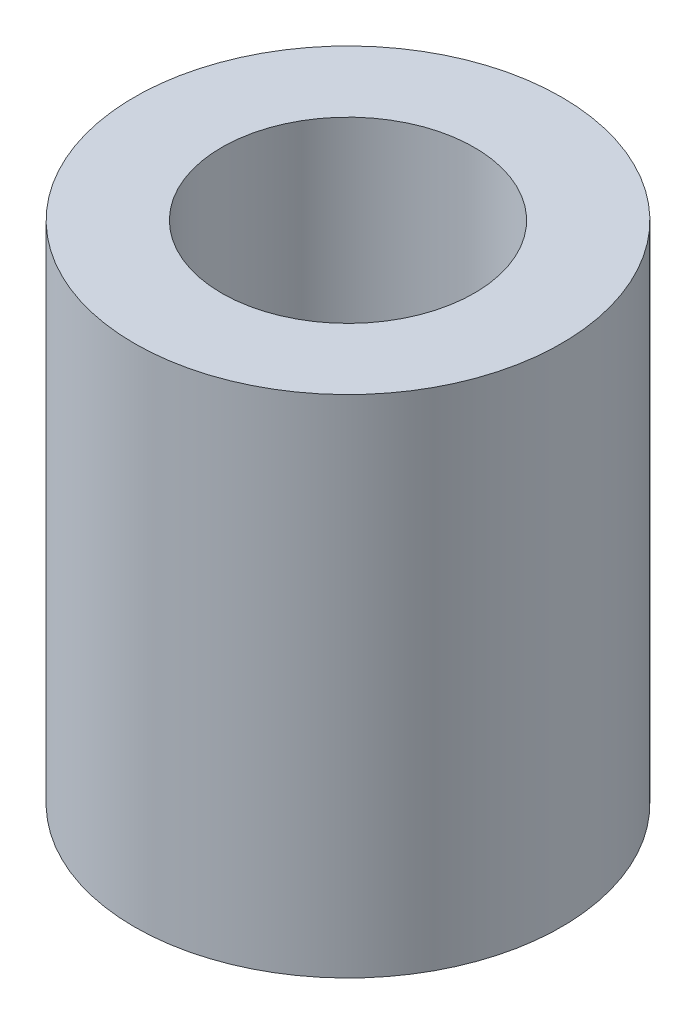
ISO-10303-21;
HEADER;
FILE_DESCRIPTION(('STEP AP214'),'2;1');
FILE_NAME('part.step','',(''),(''),'','','');
FILE_SCHEMA(('AUTOMOTIVE_DESIGN { 1 0 10303 214 1 1 1 1 }'));
ENDSEC;
DATA;
#1=APPLICATION_CONTEXT('core data for automotive mechanical design processes');
#2=APPLICATION_PROTOCOL_DEFINITION('international standard','automotive_design',2000,#1);
#3=PRODUCT_CONTEXT('',#1,'mechanical');
#4=PRODUCT('Part','Part','',(#3));
#5=PRODUCT_RELATED_PRODUCT_CATEGORY('part','',(#4));
#6=PRODUCT_DEFINITION_FORMATION('','',#4);
#7=PRODUCT_DEFINITION_CONTEXT('part definition',#1,'design');
#8=PRODUCT_DEFINITION('design','',#6,#7);
#9=PRODUCT_DEFINITION_SHAPE('','',#8);
#10=(LENGTH_UNIT() NAMED_UNIT(*) SI_UNIT(.MILLI.,.METRE.));
#11=(NAMED_UNIT(*) PLANE_ANGLE_UNIT() SI_UNIT($,.RADIAN.));
#12=(NAMED_UNIT(*) SI_UNIT($,.STERADIAN.) SOLID_ANGLE_UNIT());
#13=UNCERTAINTY_MEASURE_WITH_UNIT(LENGTH_MEASURE(1.E-05),#10,'distance_accuracy_value','');
#14=(GEOMETRIC_REPRESENTATION_CONTEXT(3) GLOBAL_UNCERTAINTY_ASSIGNED_CONTEXT((#13)) GLOBAL_UNIT_ASSIGNED_CONTEXT((#10,
#11,#12)) REPRESENTATION_CONTEXT('',''));
#15=CARTESIAN_POINT('',(0.,0.,0.));
#16=DIRECTION('',(0.,0.,1.));
#17=DIRECTION('',(1.,0.,0.));
#18=AXIS2_PLACEMENT_3D('',#15,#16,#17);
#19=CARTESIAN_POINT('',(0.,12.7,0.));
#20=DIRECTION('',(0.,1.,0.));
#21=DIRECTION('',(0.,0.,1.));
#22=AXIS2_PLACEMENT_3D('',#19,#20,#21);
#23=PLANE('',#22);
#24=CARTESIAN_POINT('',(0.,12.7,0.));
#25=DIRECTION('',(0.,1.,0.));
#26=DIRECTION('',(0.,0.,1.));
#27=AXIS2_PLACEMENT_3D('',#24,#25,#26);
#28=CIRCLE('',#27,10.7315);
#29=CARTESIAN_POINT('',(0.,12.7,10.7315));
#30=VERTEX_POINT('',#29);
#31=EDGE_CURVE('E11',#30,#30,#28,.T.);
#32=ORIENTED_EDGE('',*,*,#31,.T.);
#33=EDGE_LOOP('',(#32));
#34=FACE_BOUND('',#33,.T.);
#35=CARTESIAN_POINT('',(0.,12.7,0.));
#36=DIRECTION('',(0.,1.,0.));
#37=DIRECTION('',(0.,0.,1.));
#38=AXIS2_PLACEMENT_3D('',#35,#36,#37);
#39=CIRCLE('',#38,6.35);
#40=CARTESIAN_POINT('',(0.,12.7,6.35));
#41=VERTEX_POINT('',#40);
#42=EDGE_CURVE('E48',#41,#41,#39,.T.);
#43=ORIENTED_EDGE('',*,*,#42,.F.);
#44=EDGE_LOOP('',(#43));
#45=FACE_BOUND('',#44,.T.);
#46=ADVANCED_FACE('F37',(#34,#45),#23,.T.);
#47=CARTESIAN_POINT('',(0.,-12.7,0.));
#48=DIRECTION('',(0.,1.,0.));
#49=DIRECTION('',(0.,0.,1.));
#50=AXIS2_PLACEMENT_3D('',#47,#48,#49);
#51=PLANE('',#50);
#52=CARTESIAN_POINT('',(0.,-12.7,0.));
#53=DIRECTION('',(0.,1.,0.));
#54=DIRECTION('',(0.,0.,1.));
#55=AXIS2_PLACEMENT_3D('',#52,#53,#54);
#56=CIRCLE('',#55,10.7315);
#57=CARTESIAN_POINT('',(0.,-12.7,10.7315));
#58=VERTEX_POINT('',#57);
#59=EDGE_CURVE('E41',#58,#58,#56,.T.);
#60=ORIENTED_EDGE('',*,*,#59,.F.);
#61=EDGE_LOOP('',(#60));
#62=FACE_BOUND('',#61,.T.);
#63=CARTESIAN_POINT('',(0.,-12.7,0.));
#64=DIRECTION('',(0.,1.,0.));
#65=DIRECTION('',(0.,0.,1.));
#66=AXIS2_PLACEMENT_3D('',#63,#64,#65);
#67=CIRCLE('',#66,6.35);
#68=CARTESIAN_POINT('',(0.,-12.7,6.35));
#69=VERTEX_POINT('',#68);
#70=EDGE_CURVE('E50',#69,#69,#67,.T.);
#71=ORIENTED_EDGE('',*,*,#70,.T.);
#72=EDGE_LOOP('',(#71));
#73=FACE_BOUND('',#72,.T.);
#74=ADVANCED_FACE('F60',(#62,#73),#51,.F.);
#75=CARTESIAN_POINT('',(0.,12.7,0.));
#76=DIRECTION('',(0.,-1.,0.));
#77=DIRECTION('',(0.,0.,-1.));
#78=AXIS2_PLACEMENT_3D('',#75,#76,#77);
#79=CYLINDRICAL_SURFACE('',#78,10.7315);
#80=ORIENTED_EDGE('',*,*,#31,.F.);
#81=EDGE_LOOP('',(#80));
#82=FACE_BOUND('',#81,.T.);
#83=ORIENTED_EDGE('',*,*,#59,.T.);
#84=EDGE_LOOP('',(#83));
#85=FACE_BOUND('',#84,.T.);
#86=ADVANCED_FACE('F39',(#82,#85),#79,.T.);
#87=CARTESIAN_POINT('',(0.,12.7,0.));
#88=DIRECTION('',(0.,-1.,0.));
#89=DIRECTION('',(0.,0.,-1.));
#90=AXIS2_PLACEMENT_3D('',#87,#88,#89);
#91=CYLINDRICAL_SURFACE('',#90,6.35);
#92=ORIENTED_EDGE('',*,*,#42,.T.);
#93=EDGE_LOOP('',(#92));
#94=FACE_BOUND('',#93,.T.);
#95=ORIENTED_EDGE('',*,*,#70,.F.);
#96=EDGE_LOOP('',(#95));
#97=FACE_BOUND('',#96,.T.);
#98=ADVANCED_FACE('F56',(#94,#97),#91,.F.);
#99=CLOSED_SHELL('',(#46,#74,#86,#98));
#100=MANIFOLD_SOLID_BREP('B2',#99);
#101=ADVANCED_BREP_SHAPE_REPRESENTATION('',(#18,#100),#14);
#102=SHAPE_DEFINITION_REPRESENTATION(#9,#101);
ENDSEC;
END-ISO-10303-21;
